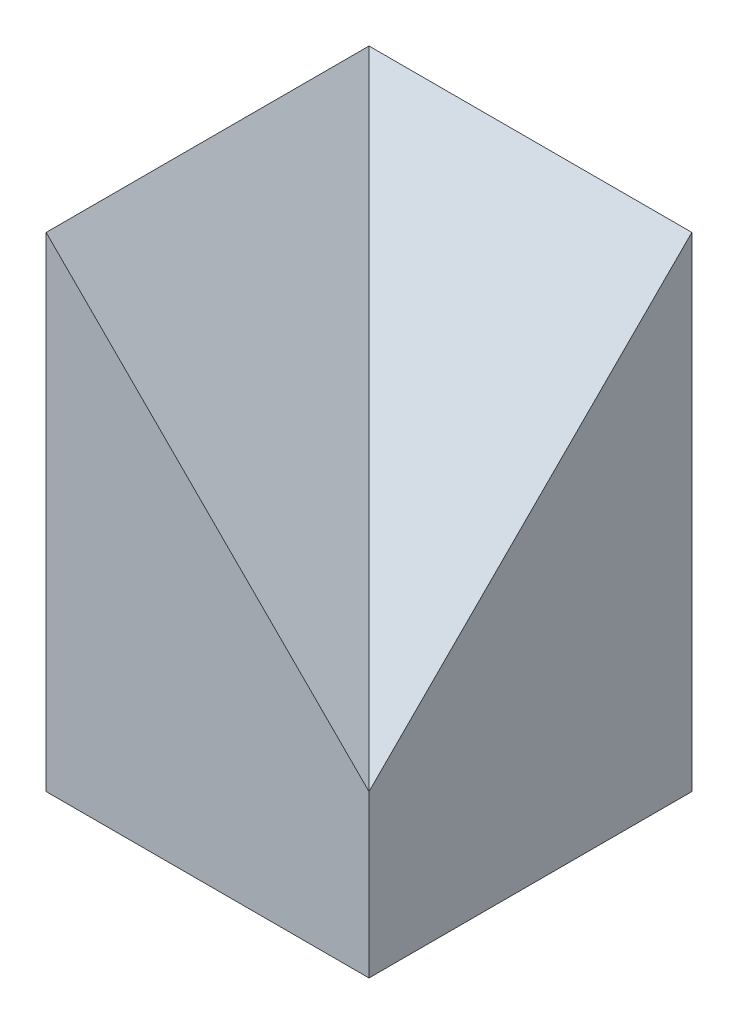
ISO-10303-21;
HEADER;
FILE_DESCRIPTION(('STEP AP214'),'2;1');
FILE_NAME('part.step','',(''),(''),'','','');
FILE_SCHEMA(('AUTOMOTIVE_DESIGN { 1 0 10303 214 1 1 1 1 }'));
ENDSEC;
DATA;
#1=APPLICATION_CONTEXT('core data for automotive mechanical design processes');
#2=APPLICATION_PROTOCOL_DEFINITION('international standard','automotive_design',2000,#1);
#3=PRODUCT_CONTEXT('',#1,'mechanical');
#4=PRODUCT('Part','Part','',(#3));
#5=PRODUCT_RELATED_PRODUCT_CATEGORY('part','',(#4));
#6=PRODUCT_DEFINITION_FORMATION('','',#4);
#7=PRODUCT_DEFINITION_CONTEXT('part definition',#1,'design');
#8=PRODUCT_DEFINITION('design','',#6,#7);
#9=PRODUCT_DEFINITION_SHAPE('','',#8);
#10=(LENGTH_UNIT() NAMED_UNIT(*) SI_UNIT(.MILLI.,.METRE.));
#11=(NAMED_UNIT(*) PLANE_ANGLE_UNIT() SI_UNIT($,.RADIAN.));
#12=(NAMED_UNIT(*) SI_UNIT($,.STERADIAN.) SOLID_ANGLE_UNIT());
#13=UNCERTAINTY_MEASURE_WITH_UNIT(LENGTH_MEASURE(1.E-05),#10,'distance_accuracy_value','');
#14=(GEOMETRIC_REPRESENTATION_CONTEXT(3) GLOBAL_UNCERTAINTY_ASSIGNED_CONTEXT((#13)) GLOBAL_UNIT_ASSIGNED_CONTEXT((#10,
#11,#12)) REPRESENTATION_CONTEXT('',''));
#15=CARTESIAN_POINT('',(0.,0.,0.));
#16=DIRECTION('',(0.,0.,1.));
#17=DIRECTION('',(1.,0.,0.));
#18=AXIS2_PLACEMENT_3D('',#15,#16,#17);
#19=CARTESIAN_POINT('',(0.,200.,0.));
#20=DIRECTION('',(1.,0.,0.));
#21=DIRECTION('',(0.,0.,-1.));
#22=AXIS2_PLACEMENT_3D('',#19,#20,#21);
#23=PLANE('',#22);
#24=DIRECTION('',(0.,0.,1.));
#25=VECTOR('',#24,1.);
#26=CARTESIAN_POINT('',(0.,0.,0.));
#27=LINE('',#26,#25);
#28=CARTESIAN_POINT('',(0.,0.,0.));
#29=VERTEX_POINT('',#28);
#30=CARTESIAN_POINT('',(0.,0.,400.));
#31=VERTEX_POINT('',#30);
#32=EDGE_CURVE('E146',#29,#31,#27,.T.);
#33=ORIENTED_EDGE('',*,*,#32,.T.);
#34=DIRECTION('',(0.,-1.,0.));
#35=VECTOR('',#34,1.);
#36=CARTESIAN_POINT('',(0.,200.,400.));
#37=LINE('',#36,#35);
#38=CARTESIAN_POINT('',(0.,600.,400.));
#39=VERTEX_POINT('',#38);
#40=EDGE_CURVE('E13',#39,#31,#37,.T.);
#41=ORIENTED_EDGE('',*,*,#40,.F.);
#42=CARTESIAN_POINT('',(0.,600.,0.));
#43=DIRECTION('',(0.,0.,1.));
#44=VECTOR('',#43,1.);
#45=LINE('',#42,#44);
#46=CARTESIAN_POINT('',(0.,600.,0.));
#47=VERTEX_POINT('',#46);
#48=EDGE_CURVE('E147',#47,#39,#45,.T.);
#49=ORIENTED_EDGE('',*,*,#48,.F.);
#50=DIRECTION('',(0.,-1.,0.));
#51=VECTOR('',#50,1.);
#52=CARTESIAN_POINT('',(0.,200.,0.));
#53=LINE('',#52,#51);
#54=EDGE_CURVE('E157',#47,#29,#53,.T.);
#55=ORIENTED_EDGE('',*,*,#54,.T.);
#56=EDGE_LOOP('',(#33,#41,#49,#55));
#57=FACE_BOUND('',#56,.T.);
#58=ADVANCED_FACE('F94',(#57),#23,.F.);
#59=CARTESIAN_POINT('',(0.,200.,400.));
#60=DIRECTION('',(0.,0.,-1.));
#61=DIRECTION('',(-1.,0.,0.));
#62=AXIS2_PLACEMENT_3D('',#59,#60,#61);
#63=PLANE('',#62);
#64=DIRECTION('',(0.,-1.,0.));
#65=VECTOR('',#64,1.);
#66=CARTESIAN_POINT('',(400.,200.,400.));
#67=LINE('',#66,#65);
#68=CARTESIAN_POINT('',(400.,200.,400.));
#69=VERTEX_POINT('',#68);
#70=CARTESIAN_POINT('',(400.,0.,400.));
#71=VERTEX_POINT('',#70);
#72=EDGE_CURVE('E103',#69,#71,#67,.T.);
#73=ORIENTED_EDGE('',*,*,#72,.F.);
#74=DIRECTION('',(0.707106781186548,-0.707106781186547,0.));
#75=VECTOR('',#74,1.);
#76=CARTESIAN_POINT('',(200.,400.,400.));
#77=LINE('',#76,#75);
#78=EDGE_CURVE('E155',#39,#69,#77,.T.);
#79=ORIENTED_EDGE('',*,*,#78,.F.);
#80=ORIENTED_EDGE('',*,*,#40,.T.);
#81=DIRECTION('',(1.,0.,0.));
#82=VECTOR('',#81,1.);
#83=CARTESIAN_POINT('',(0.,0.,400.));
#84=LINE('',#83,#82);
#85=EDGE_CURVE('E202',#31,#71,#84,.T.);
#86=ORIENTED_EDGE('',*,*,#85,.T.);
#87=EDGE_LOOP('',(#73,#79,#80,#86));
#88=FACE_BOUND('',#87,.T.);
#89=ADVANCED_FACE('F194',(#88),#63,.F.);
#90=CARTESIAN_POINT('',(400.,200.,0.));
#91=DIRECTION('',(-1.,0.,0.));
#92=DIRECTION('',(0.,0.,1.));
#93=AXIS2_PLACEMENT_3D('',#90,#91,#92);
#94=PLANE('',#93);
#95=DIRECTION('',(0.,-1.,0.));
#96=VECTOR('',#95,1.);
#97=CARTESIAN_POINT('',(400.,200.,0.));
#98=LINE('',#97,#96);
#99=CARTESIAN_POINT('',(400.,600.,0.));
#100=VERTEX_POINT('',#99);
#101=CARTESIAN_POINT('',(400.,0.,0.));
#102=VERTEX_POINT('',#101);
#103=EDGE_CURVE('E162',#100,#102,#98,.T.);
#104=ORIENTED_EDGE('',*,*,#103,.F.);
#105=DIRECTION('',(0.,-0.707106781186547,0.707106781186548));
#106=VECTOR('',#105,1.);
#107=CARTESIAN_POINT('',(400.,400.,200.));
#108=LINE('',#107,#106);
#109=EDGE_CURVE('E144',#100,#69,#108,.T.);
#110=ORIENTED_EDGE('',*,*,#109,.T.);
#111=ORIENTED_EDGE('',*,*,#72,.T.);
#112=DIRECTION('',(0.,0.,-1.));
#113=VECTOR('',#112,1.);
#114=CARTESIAN_POINT('',(400.,0.,0.));
#115=LINE('',#114,#113);
#116=EDGE_CURVE('E118',#71,#102,#115,.T.);
#117=ORIENTED_EDGE('',*,*,#116,.T.);
#118=EDGE_LOOP('',(#104,#110,#111,#117));
#119=FACE_BOUND('',#118,.T.);
#120=ADVANCED_FACE('F191',(#119),#94,.F.);
#121=CARTESIAN_POINT('',(0.,200.,0.));
#122=DIRECTION('',(0.,0.,1.));
#123=DIRECTION('',(1.,0.,0.));
#124=AXIS2_PLACEMENT_3D('',#121,#122,#123);
#125=PLANE('',#124);
#126=DIRECTION('',(-1.,0.,0.));
#127=VECTOR('',#126,1.);
#128=CARTESIAN_POINT('',(0.,0.,0.));
#129=LINE('',#128,#127);
#130=EDGE_CURVE('E110',#102,#29,#129,.T.);
#131=ORIENTED_EDGE('',*,*,#130,.T.);
#132=ORIENTED_EDGE('',*,*,#54,.F.);
#133=CARTESIAN_POINT('',(400.,600.,0.));
#134=DIRECTION('',(-1.,0.,0.));
#135=VECTOR('',#134,1.);
#136=LINE('',#133,#135);
#137=EDGE_CURVE('E138',#100,#47,#136,.T.);
#138=ORIENTED_EDGE('',*,*,#137,.F.);
#139=ORIENTED_EDGE('',*,*,#103,.T.);
#140=EDGE_LOOP('',(#131,#132,#138,#139));
#141=FACE_BOUND('',#140,.T.);
#142=ADVANCED_FACE('F158',(#141),#125,.F.);
#143=CARTESIAN_POINT('',(0.,0.,0.));
#144=DIRECTION('',(0.,1.,0.));
#145=DIRECTION('',(0.,0.,1.));
#146=AXIS2_PLACEMENT_3D('',#143,#144,#145);
#147=PLANE('',#146);
#148=ORIENTED_EDGE('',*,*,#32,.F.);
#149=ORIENTED_EDGE('',*,*,#130,.F.);
#150=ORIENTED_EDGE('',*,*,#116,.F.);
#151=ORIENTED_EDGE('',*,*,#85,.F.);
#152=EDGE_LOOP('',(#148,#149,#150,#151));
#153=FACE_BOUND('',#152,.T.);
#154=ADVANCED_FACE('F190',(#153),#147,.F.);
#155=CARTESIAN_POINT('',(0.,600.,400.));
#156=DIRECTION('',(-0.707106781186547,-0.707106781186548,0.));
#157=DIRECTION('',(0.,0.,-1.));
#158=AXIS2_PLACEMENT_3D('',#155,#156,#157);
#159=PLANE('',#158);
#160=ORIENTED_EDGE('',*,*,#48,.T.);
#161=ORIENTED_EDGE('',*,*,#78,.T.);
#162=DIRECTION('',(0.577350269189626,-0.577350269189625,0.577350269189627));
#163=VECTOR('',#162,1.);
#164=CARTESIAN_POINT('',(200.,400.,200.));
#165=LINE('',#164,#163);
#166=EDGE_CURVE('E142',#47,#69,#165,.T.);
#167=ORIENTED_EDGE('',*,*,#166,.F.);
#168=EDGE_LOOP('',(#160,#161,#167));
#169=FACE_BOUND('',#168,.T.);
#170=ADVANCED_FACE('F151',(#169),#159,.F.);
#171=CARTESIAN_POINT('',(0.,600.,0.));
#172=DIRECTION('',(0.,-0.707106781186548,-0.707106781186547));
#173=DIRECTION('',(1.,0.,0.));
#174=AXIS2_PLACEMENT_3D('',#171,#172,#173);
#175=PLANE('',#174);
#176=ORIENTED_EDGE('',*,*,#137,.T.);
#177=ORIENTED_EDGE('',*,*,#166,.T.);
#178=ORIENTED_EDGE('',*,*,#109,.F.);
#179=EDGE_LOOP('',(#176,#177,#178));
#180=FACE_BOUND('',#179,.T.);
#181=ADVANCED_FACE('F141',(#180),#175,.F.);
#182=CLOSED_SHELL('',(#58,#89,#120,#142,#154,#170,#181));
#183=MANIFOLD_SOLID_BREP('B2',#182);
#184=ADVANCED_BREP_SHAPE_REPRESENTATION('',(#18,#183),#14);
#185=SHAPE_DEFINITION_REPRESENTATION(#9,#184);
ENDSEC;
END-ISO-10303-21;
